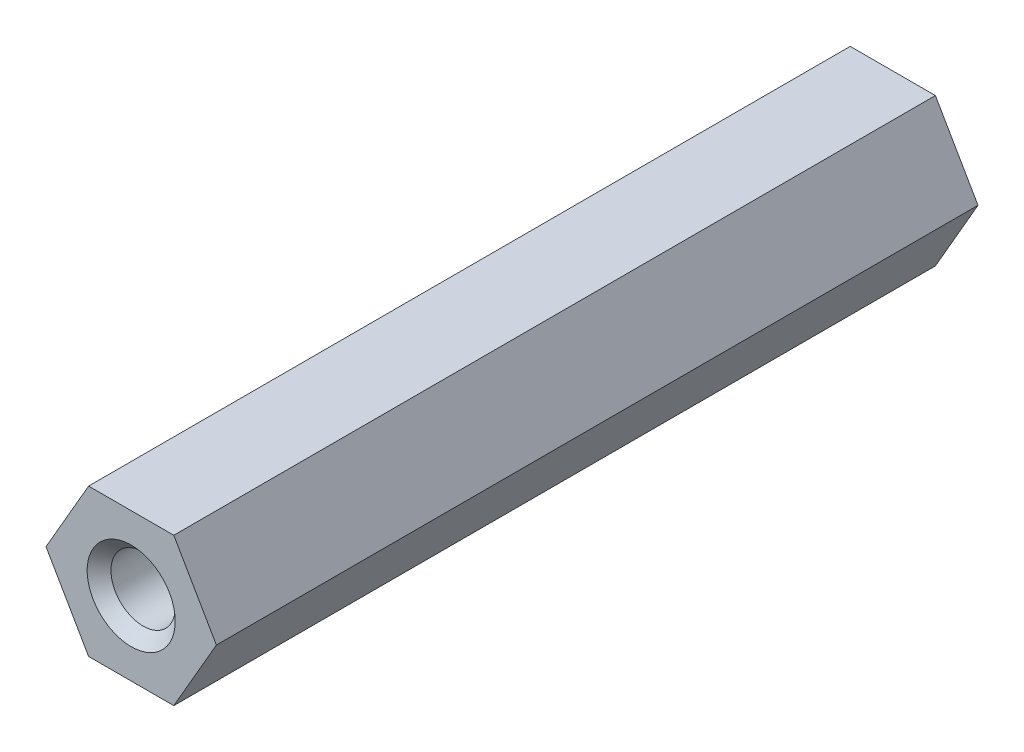
ISO-10303-21;
HEADER;
FILE_DESCRIPTION(('STEP AP214'),'2;1');
FILE_NAME('part.step','',(''),(''),'','','');
FILE_SCHEMA(('AUTOMOTIVE_DESIGN { 1 0 10303 214 1 1 1 1 }'));
ENDSEC;
DATA;
#1=APPLICATION_CONTEXT('core data for automotive mechanical design processes');
#2=APPLICATION_PROTOCOL_DEFINITION('international standard','automotive_design',2000,#1);
#3=PRODUCT_CONTEXT('',#1,'mechanical');
#4=PRODUCT('Part','Part','',(#3));
#5=PRODUCT_RELATED_PRODUCT_CATEGORY('part','',(#4));
#6=PRODUCT_DEFINITION_FORMATION('','',#4);
#7=PRODUCT_DEFINITION_CONTEXT('part definition',#1,'design');
#8=PRODUCT_DEFINITION('design','',#6,#7);
#9=PRODUCT_DEFINITION_SHAPE('','',#8);
#10=(LENGTH_UNIT() NAMED_UNIT(*) SI_UNIT(.MILLI.,.METRE.));
#11=(NAMED_UNIT(*) PLANE_ANGLE_UNIT() SI_UNIT($,.RADIAN.));
#12=(NAMED_UNIT(*) SI_UNIT($,.STERADIAN.) SOLID_ANGLE_UNIT());
#13=UNCERTAINTY_MEASURE_WITH_UNIT(LENGTH_MEASURE(1.E-05),#10,'distance_accuracy_value','');
#14=(GEOMETRIC_REPRESENTATION_CONTEXT(3) GLOBAL_UNCERTAINTY_ASSIGNED_CONTEXT((#13)) GLOBAL_UNIT_ASSIGNED_CONTEXT((#10,
#11,#12)) REPRESENTATION_CONTEXT('',''));
#15=CARTESIAN_POINT('',(0.,0.,0.));
#16=DIRECTION('',(0.,0.,1.));
#17=DIRECTION('',(1.,0.,0.));
#18=AXIS2_PLACEMENT_3D('',#15,#16,#17);
#19=CARTESIAN_POINT('',(-26.2468716349548,-11.1145142617312,4.23950473579816));
#20=DIRECTION('',(0.866025403784439,-0.5,0.));
#21=DIRECTION('',(0.5,0.866025403784439,0.));
#22=AXIS2_PLACEMENT_3D('',#19,#20,#21);
#23=PLANE('',#22);
#24=DIRECTION('',(-0.500000000000001,-0.866025403784438,0.));
#25=VECTOR('',#24,1.);
#26=CARTESIAN_POINT('',(-24.4570858004669,-8.01451426173116,4.23950473579816));
#27=LINE('',#26,#25);
#28=CARTESIAN_POINT('',(-24.4570858004669,-8.01451426173116,4.23950473579816));
#29=VERTEX_POINT('',#28);
#30=CARTESIAN_POINT('',(-26.2468716349548,-11.1145142617312,4.23950473579816));
#31=VERTEX_POINT('',#30);
#32=EDGE_CURVE('E124',#29,#31,#27,.T.);
#33=ORIENTED_EDGE('',*,*,#32,.F.);
#34=DIRECTION('',(0.,0.,1.));
#35=VECTOR('',#34,1.);
#36=CARTESIAN_POINT('',(-24.4570858004669,-8.01451426173116,4.23950473579816));
#37=LINE('',#36,#35);
#38=CARTESIAN_POINT('',(-24.4570858004669,-8.01451426173116,36.2395047357982));
#39=VERTEX_POINT('',#38);
#40=EDGE_CURVE('E97',#39,#29,#37,.F.);
#41=ORIENTED_EDGE('',*,*,#40,.F.);
#42=DIRECTION('',(-0.500000000000001,-0.866025403784438,0.));
#43=VECTOR('',#42,1.);
#44=CARTESIAN_POINT('',(-24.4570858004669,-8.01451426173116,36.2395047357982));
#45=LINE('',#44,#43);
#46=CARTESIAN_POINT('',(-26.2468716349548,-11.1145142617312,36.2395047357982));
#47=VERTEX_POINT('',#46);
#48=EDGE_CURVE('E126',#39,#47,#45,.T.);
#49=ORIENTED_EDGE('',*,*,#48,.T.);
#50=DIRECTION('',(0.,0.,-1.));
#51=VECTOR('',#50,1.);
#52=CARTESIAN_POINT('',(-26.2468716349548,-11.1145142617312,4.23950473579816));
#53=LINE('',#52,#51);
#54=EDGE_CURVE('E67',#31,#47,#53,.F.);
#55=ORIENTED_EDGE('',*,*,#54,.F.);
#56=EDGE_LOOP('',(#33,#41,#49,#55));
#57=FACE_BOUND('',#56,.T.);
#58=ADVANCED_FACE('F16',(#57),#23,.T.);
#59=CARTESIAN_POINT('',(-29.8264433039305,-11.1145142617312,4.23950473579816));
#60=DIRECTION('',(0.,-1.,0.));
#61=DIRECTION('',(0.,0.,-1.));
#62=AXIS2_PLACEMENT_3D('',#59,#60,#61);
#63=PLANE('',#62);
#64=DIRECTION('',(-1.,0.,0.));
#65=VECTOR('',#64,1.);
#66=CARTESIAN_POINT('',(-28.0366574694426,-11.1145142617312,4.23950473579816));
#67=LINE('',#66,#65);
#68=CARTESIAN_POINT('',(-29.8264433039305,-11.1145142617312,4.23950473579816));
#69=VERTEX_POINT('',#68);
#70=EDGE_CURVE('E122',#31,#69,#67,.T.);
#71=ORIENTED_EDGE('',*,*,#70,.F.);
#72=ORIENTED_EDGE('',*,*,#54,.T.);
#73=DIRECTION('',(-1.,0.,0.));
#74=VECTOR('',#73,1.);
#75=CARTESIAN_POINT('',(-28.0366574694426,-11.1145142617312,36.2395047357982));
#76=LINE('',#75,#74);
#77=CARTESIAN_POINT('',(-29.8264433039305,-11.1145142617312,36.2395047357982));
#78=VERTEX_POINT('',#77);
#79=EDGE_CURVE('E88',#47,#78,#76,.T.);
#80=ORIENTED_EDGE('',*,*,#79,.T.);
#81=DIRECTION('',(0.,0.,1.));
#82=VECTOR('',#81,1.);
#83=CARTESIAN_POINT('',(-29.8264433039305,-11.1145142617312,4.23950473579816));
#84=LINE('',#83,#82);
#85=EDGE_CURVE('E74',#69,#78,#84,.T.);
#86=ORIENTED_EDGE('',*,*,#85,.F.);
#87=EDGE_LOOP('',(#71,#72,#80,#86));
#88=FACE_BOUND('',#87,.T.);
#89=ADVANCED_FACE('F94',(#88),#63,.T.);
#90=CARTESIAN_POINT('',(-31.6162291384183,-8.01451426173116,4.23950473579816));
#91=DIRECTION('',(-0.866025403784439,-0.5,0.));
#92=DIRECTION('',(0.5,-0.866025403784439,0.));
#93=AXIS2_PLACEMENT_3D('',#90,#91,#92);
#94=PLANE('',#93);
#95=DIRECTION('',(-0.5,0.866025403784438,0.));
#96=VECTOR('',#95,1.);
#97=CARTESIAN_POINT('',(-29.8264433039305,-11.1145142617312,4.23950473579816));
#98=LINE('',#97,#96);
#99=CARTESIAN_POINT('',(-31.6162291384183,-8.01451426173116,4.23950473579816));
#100=VERTEX_POINT('',#99);
#101=EDGE_CURVE('E79',#69,#100,#98,.T.);
#102=ORIENTED_EDGE('',*,*,#101,.F.);
#103=ORIENTED_EDGE('',*,*,#85,.T.);
#104=DIRECTION('',(-0.5,0.866025403784438,0.));
#105=VECTOR('',#104,1.);
#106=CARTESIAN_POINT('',(-29.8264433039305,-11.1145142617312,36.2395047357982));
#107=LINE('',#106,#105);
#108=CARTESIAN_POINT('',(-31.6162291384183,-8.01451426173116,36.2395047357982));
#109=VERTEX_POINT('',#108);
#110=EDGE_CURVE('E78',#78,#109,#107,.T.);
#111=ORIENTED_EDGE('',*,*,#110,.T.);
#112=DIRECTION('',(0.,0.,1.));
#113=VECTOR('',#112,1.);
#114=CARTESIAN_POINT('',(-31.6162291384183,-8.01451426173117,4.23950473579816));
#115=LINE('',#114,#113);
#116=EDGE_CURVE('E80',#100,#109,#115,.T.);
#117=ORIENTED_EDGE('',*,*,#116,.F.);
#118=EDGE_LOOP('',(#102,#103,#111,#117));
#119=FACE_BOUND('',#118,.T.);
#120=ADVANCED_FACE('F76',(#119),#94,.T.);
#121=CARTESIAN_POINT('',(-29.8264433039305,-4.91451426173116,4.23950473579816));
#122=DIRECTION('',(-0.866025403784439,0.5,0.));
#123=DIRECTION('',(-0.5,-0.866025403784439,0.));
#124=AXIS2_PLACEMENT_3D('',#121,#122,#123);
#125=PLANE('',#124);
#126=DIRECTION('',(0.5,0.866025403784438,0.));
#127=VECTOR('',#126,1.);
#128=CARTESIAN_POINT('',(-31.6162291384183,-8.01451426173116,4.23950473579816));
#129=LINE('',#128,#127);
#130=CARTESIAN_POINT('',(-29.8264433039305,-4.91451426173116,4.23950473579816));
#131=VERTEX_POINT('',#130);
#132=EDGE_CURVE('E117',#100,#131,#129,.T.);
#133=ORIENTED_EDGE('',*,*,#132,.F.);
#134=ORIENTED_EDGE('',*,*,#116,.T.);
#135=DIRECTION('',(0.5,0.866025403784438,0.));
#136=VECTOR('',#135,1.);
#137=CARTESIAN_POINT('',(-31.6162291384183,-8.01451426173116,36.2395047357982));
#138=LINE('',#137,#136);
#139=CARTESIAN_POINT('',(-29.8264433039305,-4.91451426173116,36.2395047357982));
#140=VERTEX_POINT('',#139);
#141=EDGE_CURVE('E92',#109,#140,#138,.T.);
#142=ORIENTED_EDGE('',*,*,#141,.T.);
#143=DIRECTION('',(0.,0.,1.));
#144=VECTOR('',#143,1.);
#145=CARTESIAN_POINT('',(-29.8264433039305,-4.91451426173116,4.23950473579816));
#146=LINE('',#145,#144);
#147=EDGE_CURVE('E105',#131,#140,#146,.T.);
#148=ORIENTED_EDGE('',*,*,#147,.F.);
#149=EDGE_LOOP('',(#133,#134,#142,#148));
#150=FACE_BOUND('',#149,.T.);
#151=ADVANCED_FACE('F136',(#150),#125,.T.);
#152=CARTESIAN_POINT('',(-26.2468716349548,-4.91451426173116,4.23950473579816));
#153=DIRECTION('',(0.,1.,0.));
#154=DIRECTION('',(-1.,0.,0.));
#155=AXIS2_PLACEMENT_3D('',#152,#153,#154);
#156=PLANE('',#155);
#157=DIRECTION('',(-1.,0.,0.));
#158=VECTOR('',#157,1.);
#159=CARTESIAN_POINT('',(-28.0366574694426,-4.91451426173116,4.23950473579816));
#160=LINE('',#159,#158);
#161=CARTESIAN_POINT('',(-26.2468716349548,-4.91451426173116,4.23950473579816));
#162=VERTEX_POINT('',#161);
#163=EDGE_CURVE('E34',#131,#162,#160,.F.);
#164=ORIENTED_EDGE('',*,*,#163,.F.);
#165=ORIENTED_EDGE('',*,*,#147,.T.);
#166=DIRECTION('',(-1.,0.,0.));
#167=VECTOR('',#166,1.);
#168=CARTESIAN_POINT('',(-28.0366574694426,-4.91451426173116,36.2395047357982));
#169=LINE('',#168,#167);
#170=CARTESIAN_POINT('',(-26.2468716349548,-4.91451426173116,36.2395047357982));
#171=VERTEX_POINT('',#170);
#172=EDGE_CURVE('E131',#140,#171,#169,.F.);
#173=ORIENTED_EDGE('',*,*,#172,.T.);
#174=DIRECTION('',(0.,0.,1.));
#175=VECTOR('',#174,1.);
#176=CARTESIAN_POINT('',(-26.2468716349548,-4.91451426173116,4.23950473579816));
#177=LINE('',#176,#175);
#178=EDGE_CURVE('E95',#162,#171,#177,.T.);
#179=ORIENTED_EDGE('',*,*,#178,.F.);
#180=EDGE_LOOP('',(#164,#165,#173,#179));
#181=FACE_BOUND('',#180,.T.);
#182=ADVANCED_FACE('F142',(#181),#156,.T.);
#183=CARTESIAN_POINT('',(-24.4570858004669,-8.01451426173116,4.23950473579816));
#184=DIRECTION('',(0.866025403784439,0.5,0.));
#185=DIRECTION('',(-0.5,0.866025403784439,0.));
#186=AXIS2_PLACEMENT_3D('',#183,#184,#185);
#187=PLANE('',#186);
#188=DIRECTION('',(0.500000000000001,-0.866025403784438,0.));
#189=VECTOR('',#188,1.);
#190=CARTESIAN_POINT('',(-26.2468716349548,-4.91451426173116,4.23950473579816));
#191=LINE('',#190,#189);
#192=EDGE_CURVE('E112',#162,#29,#191,.T.);
#193=ORIENTED_EDGE('',*,*,#192,.F.);
#194=ORIENTED_EDGE('',*,*,#178,.T.);
#195=DIRECTION('',(0.500000000000001,-0.866025403784438,0.));
#196=VECTOR('',#195,1.);
#197=CARTESIAN_POINT('',(-26.2468716349548,-4.91451426173116,36.2395047357982));
#198=LINE('',#197,#196);
#199=EDGE_CURVE('E128',#171,#39,#198,.T.);
#200=ORIENTED_EDGE('',*,*,#199,.T.);
#201=ORIENTED_EDGE('',*,*,#40,.T.);
#202=EDGE_LOOP('',(#193,#194,#200,#201));
#203=FACE_BOUND('',#202,.T.);
#204=ADVANCED_FACE('F140',(#203),#187,.T.);
#205=CARTESIAN_POINT('',(-28.0366574694426,-14.2145142617312,36.2395047357982));
#206=DIRECTION('',(0.,0.,-1.));
#207=DIRECTION('',(-1.,0.,0.));
#208=AXIS2_PLACEMENT_3D('',#205,#206,#207);
#209=PLANE('',#208);
#210=ORIENTED_EDGE('',*,*,#199,.F.);
#211=ORIENTED_EDGE('',*,*,#172,.F.);
#212=ORIENTED_EDGE('',*,*,#141,.F.);
#213=ORIENTED_EDGE('',*,*,#110,.F.);
#214=ORIENTED_EDGE('',*,*,#79,.F.);
#215=ORIENTED_EDGE('',*,*,#48,.F.);
#216=EDGE_LOOP('',(#210,#211,#212,#213,#214,#215));
#217=FACE_BOUND('',#216,.T.);
#218=CARTESIAN_POINT('',(-28.0366574694426,-8.01451426173116,36.2395047358177));
#219=DIRECTION('',(0.,0.,1.));
#220=DIRECTION('',(1.,0.,0.));
#221=AXIS2_PLACEMENT_3D('',#218,#219,#220);
#222=CIRCLE('',#221,1.84999999993352);
#223=CARTESIAN_POINT('',(-26.1866574695091,-8.01451426173116,36.2395047358177));
#224=VERTEX_POINT('',#223);
#225=EDGE_CURVE('E19',#224,#224,#222,.F.);
#226=ORIENTED_EDGE('',*,*,#225,.T.);
#227=EDGE_LOOP('',(#226));
#228=FACE_BOUND('',#227,.T.);
#229=ADVANCED_FACE('F85',(#217,#228),#209,.F.);
#230=CARTESIAN_POINT('',(-28.0366574694426,-14.2145142617312,4.23950473579816));
#231=DIRECTION('',(0.,0.,-1.));
#232=DIRECTION('',(-1.,0.,0.));
#233=AXIS2_PLACEMENT_3D('',#230,#231,#232);
#234=PLANE('',#233);
#235=ORIENTED_EDGE('',*,*,#163,.T.);
#236=ORIENTED_EDGE('',*,*,#192,.T.);
#237=ORIENTED_EDGE('',*,*,#32,.T.);
#238=ORIENTED_EDGE('',*,*,#70,.T.);
#239=ORIENTED_EDGE('',*,*,#101,.T.);
#240=ORIENTED_EDGE('',*,*,#132,.T.);
#241=EDGE_LOOP('',(#235,#236,#237,#238,#239,#240));
#242=FACE_BOUND('',#241,.T.);
#243=CARTESIAN_POINT('',(-28.0366574694426,-8.01451426173116,4.23950473583545));
#244=DIRECTION('',(0.,0.,-1.));
#245=DIRECTION('',(-1.,0.,0.));
#246=AXIS2_PLACEMENT_3D('',#243,#244,#245);
#247=CIRCLE('',#246,1.84999999993352);
#248=CARTESIAN_POINT('',(-29.8866574693761,-8.01451426173116,4.23950473583545));
#249=VERTEX_POINT('',#248);
#250=EDGE_CURVE('E102',#249,#249,#247,.F.);
#251=ORIENTED_EDGE('',*,*,#250,.T.);
#252=EDGE_LOOP('',(#251));
#253=FACE_BOUND('',#252,.T.);
#254=ADVANCED_FACE('F137',(#242,#253),#234,.T.);
#255=CARTESIAN_POINT('',(-28.0366574694426,-8.01451426173116,36.2395047358177));
#256=DIRECTION('',(0.,0.,1.));
#257=DIRECTION('',(1.,0.,0.));
#258=AXIS2_PLACEMENT_3D('',#255,#256,#257);
#259=CONICAL_SURFACE('',#258,1.84999999993352,0.785398163340605);
#260=ORIENTED_EDGE('',*,*,#225,.F.);
#261=EDGE_LOOP('',(#260));
#262=FACE_BOUND('',#261,.T.);
#263=CARTESIAN_POINT('',(-28.0366574694426,-8.01451426173116,35.7395047357981));
#264=DIRECTION('',(0.,0.,1.));
#265=DIRECTION('',(1.,0.,0.));
#266=AXIS2_PLACEMENT_3D('',#263,#264,#265);
#267=CIRCLE('',#266,1.35);
#268=CARTESIAN_POINT('',(-26.6866574694426,-8.01451426173116,35.7395047357981));
#269=VERTEX_POINT('',#268);
#270=EDGE_CURVE('E25',#269,#269,#267,.F.);
#271=ORIENTED_EDGE('',*,*,#270,.T.);
#272=EDGE_LOOP('',(#271));
#273=FACE_BOUND('',#272,.T.);
#274=ADVANCED_FACE('F160',(#262,#273),#259,.F.);
#275=CARTESIAN_POINT('',(-28.0366574694426,-8.01451426173116,4.2395047358923));
#276=DIRECTION('',(0.,0.,-1.));
#277=DIRECTION('',(-1.,0.,0.));
#278=AXIS2_PLACEMENT_3D('',#275,#276,#277);
#279=CONICAL_SURFACE('',#278,1.84999999987667,0.785398163397448);
#280=CARTESIAN_POINT('',(-28.0366574694426,-8.01451426173116,4.73950473579817));
#281=DIRECTION('',(0.,0.,1.));
#282=DIRECTION('',(1.,0.,0.));
#283=AXIS2_PLACEMENT_3D('',#280,#281,#282);
#284=CIRCLE('',#283,1.35);
#285=CARTESIAN_POINT('',(-26.6866574694426,-8.01451426173116,4.73950473579817));
#286=VERTEX_POINT('',#285);
#287=EDGE_CURVE('E11',#286,#286,#284,.T.);
#288=ORIENTED_EDGE('',*,*,#287,.T.);
#289=EDGE_LOOP('',(#288));
#290=FACE_BOUND('',#289,.T.);
#291=ORIENTED_EDGE('',*,*,#250,.F.);
#292=EDGE_LOOP('',(#291));
#293=FACE_BOUND('',#292,.T.);
#294=ADVANCED_FACE('F154',(#290,#293),#279,.F.);
#295=CARTESIAN_POINT('',(-28.0366574694426,-8.01451426173116,4.23950473579816));
#296=DIRECTION('',(0.,0.,1.));
#297=DIRECTION('',(1.,0.,0.));
#298=AXIS2_PLACEMENT_3D('',#295,#296,#297);
#299=CYLINDRICAL_SURFACE('',#298,1.35);
#300=ORIENTED_EDGE('',*,*,#270,.F.);
#301=EDGE_LOOP('',(#300));
#302=FACE_BOUND('',#301,.T.);
#303=ORIENTED_EDGE('',*,*,#287,.F.);
#304=EDGE_LOOP('',(#303));
#305=FACE_BOUND('',#304,.T.);
#306=ADVANCED_FACE('F152',(#302,#305),#299,.F.);
#307=CLOSED_SHELL('',(#58,#89,#120,#151,#182,#204,#229,#254,#274,#294,#306));
#308=MANIFOLD_SOLID_BREP('B1',#307);
#309=ADVANCED_BREP_SHAPE_REPRESENTATION('',(#18,#308),#14);
#310=SHAPE_DEFINITION_REPRESENTATION(#9,#309);
ENDSEC;
END-ISO-10303-21;
